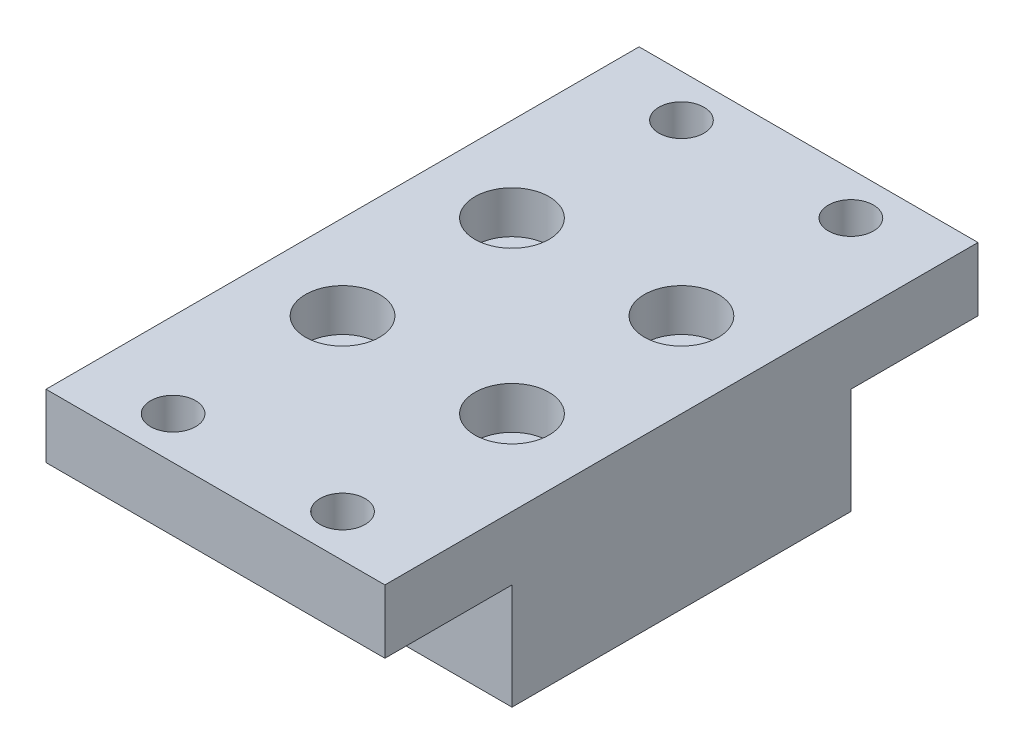
ISO-10303-21;
HEADER;
FILE_DESCRIPTION(('STEP AP214'),'2;1');
FILE_NAME('part.step','',(''),(''),'','','');
FILE_SCHEMA(('AUTOMOTIVE_DESIGN { 1 0 10303 214 1 1 1 1 }'));
ENDSEC;
DATA;
#1=APPLICATION_CONTEXT('core data for automotive mechanical design processes');
#2=APPLICATION_PROTOCOL_DEFINITION('international standard','automotive_design',2000,#1);
#3=PRODUCT_CONTEXT('',#1,'mechanical');
#4=PRODUCT('Part','Part','',(#3));
#5=PRODUCT_RELATED_PRODUCT_CATEGORY('part','',(#4));
#6=PRODUCT_DEFINITION_FORMATION('','',#4);
#7=PRODUCT_DEFINITION_CONTEXT('part definition',#1,'design');
#8=PRODUCT_DEFINITION('design','',#6,#7);
#9=PRODUCT_DEFINITION_SHAPE('','',#8);
#10=(LENGTH_UNIT() NAMED_UNIT(*) SI_UNIT(.MILLI.,.METRE.));
#11=(NAMED_UNIT(*) PLANE_ANGLE_UNIT() SI_UNIT($,.RADIAN.));
#12=(NAMED_UNIT(*) SI_UNIT($,.STERADIAN.) SOLID_ANGLE_UNIT());
#13=UNCERTAINTY_MEASURE_WITH_UNIT(LENGTH_MEASURE(1.E-05),#10,'distance_accuracy_value','');
#14=(GEOMETRIC_REPRESENTATION_CONTEXT(3) GLOBAL_UNCERTAINTY_ASSIGNED_CONTEXT((#13)) GLOBAL_UNIT_ASSIGNED_CONTEXT((#10,
#11,#12)) REPRESENTATION_CONTEXT('',''));
#15=CARTESIAN_POINT('',(0.,0.,0.));
#16=DIRECTION('',(0.,0.,1.));
#17=DIRECTION('',(1.,0.,0.));
#18=AXIS2_PLACEMENT_3D('',#15,#16,#17);
#19=CARTESIAN_POINT('',(0.,25.4,-50.8));
#20=DIRECTION('',(0.,-1.,0.));
#21=DIRECTION('',(0.,0.,-1.));
#22=AXIS2_PLACEMENT_3D('',#19,#20,#21);
#23=PLANE('',#22);
#24=CARTESIAN_POINT('',(12.7,25.4,-38.1));
#25=DIRECTION('',(0.,1.,0.));
#26=DIRECTION('',(0.,0.,1.));
#27=AXIS2_PLACEMENT_3D('',#24,#25,#26);
#28=CIRCLE('',#27,5.55625);
#29=CARTESIAN_POINT('',(12.7,25.4,-32.54375));
#30=VERTEX_POINT('',#29);
#31=EDGE_CURVE('E266',#30,#30,#28,.T.);
#32=ORIENTED_EDGE('',*,*,#31,.F.);
#33=EDGE_LOOP('',(#32));
#34=FACE_BOUND('',#33,.T.);
#35=CARTESIAN_POINT('',(38.1,25.4,12.7));
#36=DIRECTION('',(0.,1.,0.));
#37=DIRECTION('',(0.,0.,1.));
#38=AXIS2_PLACEMENT_3D('',#35,#36,#37);
#39=CIRCLE('',#38,3.3782);
#40=CARTESIAN_POINT('',(38.1,25.4,16.0782));
#41=VERTEX_POINT('',#40);
#42=EDGE_CURVE('E282',#41,#41,#39,.T.);
#43=ORIENTED_EDGE('',*,*,#42,.F.);
#44=EDGE_LOOP('',(#43));
#45=FACE_BOUND('',#44,.T.);
#46=CARTESIAN_POINT('',(38.1,25.4,-63.5));
#47=DIRECTION('',(0.,1.,0.));
#48=DIRECTION('',(0.,0.,1.));
#49=AXIS2_PLACEMENT_3D('',#46,#47,#48);
#50=CIRCLE('',#49,3.3782);
#51=CARTESIAN_POINT('',(38.1,25.4,-60.1218));
#52=VERTEX_POINT('',#51);
#53=EDGE_CURVE('E138',#52,#52,#50,.T.);
#54=ORIENTED_EDGE('',*,*,#53,.F.);
#55=EDGE_LOOP('',(#54));
#56=FACE_BOUND('',#55,.T.);
#57=CARTESIAN_POINT('',(12.7,25.4,-12.7));
#58=DIRECTION('',(0.,1.,0.));
#59=DIRECTION('',(0.,0.,1.));
#60=AXIS2_PLACEMENT_3D('',#57,#58,#59);
#61=CIRCLE('',#60,5.55625);
#62=CARTESIAN_POINT('',(12.7,25.4,-7.14375));
#63=VERTEX_POINT('',#62);
#64=EDGE_CURVE('E137',#63,#63,#61,.T.);
#65=ORIENTED_EDGE('',*,*,#64,.F.);
#66=EDGE_LOOP('',(#65));
#67=FACE_BOUND('',#66,.T.);
#68=CARTESIAN_POINT('',(12.7,25.4,-63.5));
#69=DIRECTION('',(0.,1.,0.));
#70=DIRECTION('',(0.,0.,1.));
#71=AXIS2_PLACEMENT_3D('',#68,#69,#70);
#72=CIRCLE('',#71,3.3782);
#73=CARTESIAN_POINT('',(12.7,25.4,-60.1218));
#74=VERTEX_POINT('',#73);
#75=EDGE_CURVE('E133',#74,#74,#72,.T.);
#76=ORIENTED_EDGE('',*,*,#75,.F.);
#77=EDGE_LOOP('',(#76));
#78=FACE_BOUND('',#77,.T.);
#79=DIRECTION('',(0.,0.,1.));
#80=VECTOR('',#79,1.);
#81=CARTESIAN_POINT('',(0.,25.4,0.));
#82=LINE('',#81,#80);
#83=CARTESIAN_POINT('',(0.,25.4,-69.85));
#84=VERTEX_POINT('',#83);
#85=CARTESIAN_POINT('',(0.,25.4,19.05));
#86=VERTEX_POINT('',#85);
#87=EDGE_CURVE('E193',#84,#86,#82,.T.);
#88=ORIENTED_EDGE('',*,*,#87,.T.);
#89=DIRECTION('',(-1.,0.,0.));
#90=VECTOR('',#89,1.);
#91=CARTESIAN_POINT('',(0.,25.4,19.05));
#92=LINE('',#91,#90);
#93=CARTESIAN_POINT('',(50.8,25.4,19.05));
#94=VERTEX_POINT('',#93);
#95=EDGE_CURVE('E117',#94,#86,#92,.T.);
#96=ORIENTED_EDGE('',*,*,#95,.F.);
#97=DIRECTION('',(0.,0.,-1.));
#98=VECTOR('',#97,1.);
#99=CARTESIAN_POINT('',(50.8,25.4,0.));
#100=LINE('',#99,#98);
#101=CARTESIAN_POINT('',(50.8,25.4,-69.85));
#102=VERTEX_POINT('',#101);
#103=EDGE_CURVE('E186',#94,#102,#100,.T.);
#104=ORIENTED_EDGE('',*,*,#103,.T.);
#105=DIRECTION('',(1.,0.,0.));
#106=VECTOR('',#105,1.);
#107=CARTESIAN_POINT('',(50.8,25.4,-69.85));
#108=LINE('',#107,#106);
#109=EDGE_CURVE('E207',#84,#102,#108,.T.);
#110=ORIENTED_EDGE('',*,*,#109,.F.);
#111=EDGE_LOOP('',(#88,#96,#104,#110));
#112=FACE_BOUND('',#111,.T.);
#113=CARTESIAN_POINT('',(12.7,25.4,12.7));
#114=DIRECTION('',(0.,1.,0.));
#115=DIRECTION('',(0.,0.,1.));
#116=AXIS2_PLACEMENT_3D('',#113,#114,#115);
#117=CIRCLE('',#116,3.3782);
#118=CARTESIAN_POINT('',(12.7,25.4,16.0782));
#119=VERTEX_POINT('',#118);
#120=EDGE_CURVE('E249',#119,#119,#117,.T.);
#121=ORIENTED_EDGE('',*,*,#120,.F.);
#122=EDGE_LOOP('',(#121));
#123=FACE_BOUND('',#122,.T.);
#124=CARTESIAN_POINT('',(38.1,25.4,-12.7));
#125=DIRECTION('',(0.,1.,0.));
#126=DIRECTION('',(0.,0.,1.));
#127=AXIS2_PLACEMENT_3D('',#124,#125,#126);
#128=CIRCLE('',#127,5.55625);
#129=CARTESIAN_POINT('',(38.1,25.4,-7.14375));
#130=VERTEX_POINT('',#129);
#131=EDGE_CURVE('E253',#130,#130,#128,.T.);
#132=ORIENTED_EDGE('',*,*,#131,.F.);
#133=EDGE_LOOP('',(#132));
#134=FACE_BOUND('',#133,.T.);
#135=CARTESIAN_POINT('',(38.1,25.4,-38.1));
#136=DIRECTION('',(0.,1.,0.));
#137=DIRECTION('',(0.,0.,1.));
#138=AXIS2_PLACEMENT_3D('',#135,#136,#137);
#139=CIRCLE('',#138,5.55625);
#140=CARTESIAN_POINT('',(38.1,25.4,-32.54375));
#141=VERTEX_POINT('',#140);
#142=EDGE_CURVE('E256',#141,#141,#139,.T.);
#143=ORIENTED_EDGE('',*,*,#142,.F.);
#144=EDGE_LOOP('',(#143));
#145=FACE_BOUND('',#144,.T.);
#146=ADVANCED_FACE('F34',(#34,#45,#56,#67,#78,#112,#123,#134,#145),#23,.F.);
#147=CARTESIAN_POINT('',(0.,25.4,0.));
#148=DIRECTION('',(0.,0.,-1.));
#149=DIRECTION('',(-1.,0.,0.));
#150=AXIS2_PLACEMENT_3D('',#147,#148,#149);
#151=PLANE('',#150);
#152=DIRECTION('',(1.,0.,0.));
#153=VECTOR('',#152,1.);
#154=CARTESIAN_POINT('',(0.,15.875,0.));
#155=LINE('',#154,#153);
#156=CARTESIAN_POINT('',(0.,15.875,0.));
#157=VERTEX_POINT('',#156);
#158=CARTESIAN_POINT('',(50.8,15.875,0.));
#159=VERTEX_POINT('',#158);
#160=EDGE_CURVE('E50',#157,#159,#155,.T.);
#161=ORIENTED_EDGE('',*,*,#160,.F.);
#162=DIRECTION('',(0.,-1.,0.));
#163=VECTOR('',#162,1.);
#164=CARTESIAN_POINT('',(0.,25.4,0.));
#165=LINE('',#164,#163);
#166=CARTESIAN_POINT('',(0.,0.,0.));
#167=VERTEX_POINT('',#166);
#168=EDGE_CURVE('E11',#157,#167,#165,.T.);
#169=ORIENTED_EDGE('',*,*,#168,.T.);
#170=DIRECTION('',(1.,0.,0.));
#171=VECTOR('',#170,1.);
#172=CARTESIAN_POINT('',(0.,0.,0.));
#173=LINE('',#172,#171);
#174=CARTESIAN_POINT('',(50.8,0.,0.));
#175=VERTEX_POINT('',#174);
#176=EDGE_CURVE('E197',#167,#175,#173,.T.);
#177=ORIENTED_EDGE('',*,*,#176,.T.);
#178=DIRECTION('',(0.,-1.,0.));
#179=VECTOR('',#178,1.);
#180=CARTESIAN_POINT('',(50.8,25.4,0.));
#181=LINE('',#180,#179);
#182=EDGE_CURVE('E43',#159,#175,#181,.T.);
#183=ORIENTED_EDGE('',*,*,#182,.F.);
#184=EDGE_LOOP('',(#161,#169,#177,#183));
#185=FACE_BOUND('',#184,.T.);
#186=ADVANCED_FACE('F229',(#185),#151,.F.);
#187=CARTESIAN_POINT('',(0.,25.4,-50.8));
#188=DIRECTION('',(0.,0.,1.));
#189=DIRECTION('',(1.,0.,0.));
#190=AXIS2_PLACEMENT_3D('',#187,#188,#189);
#191=PLANE('',#190);
#192=DIRECTION('',(-1.,0.,0.));
#193=VECTOR('',#192,1.);
#194=CARTESIAN_POINT('',(50.8,15.875,-50.8));
#195=LINE('',#194,#193);
#196=CARTESIAN_POINT('',(50.8,15.875,-50.8));
#197=VERTEX_POINT('',#196);
#198=CARTESIAN_POINT('',(0.,15.875,-50.8));
#199=VERTEX_POINT('',#198);
#200=EDGE_CURVE('E58',#197,#199,#195,.T.);
#201=ORIENTED_EDGE('',*,*,#200,.F.);
#202=DIRECTION('',(0.,-1.,0.));
#203=VECTOR('',#202,1.);
#204=CARTESIAN_POINT('',(50.8,25.4,-50.8));
#205=LINE('',#204,#203);
#206=CARTESIAN_POINT('',(50.8,0.,-50.8));
#207=VERTEX_POINT('',#206);
#208=EDGE_CURVE('E185',#197,#207,#205,.T.);
#209=ORIENTED_EDGE('',*,*,#208,.T.);
#210=DIRECTION('',(-1.,0.,0.));
#211=VECTOR('',#210,1.);
#212=CARTESIAN_POINT('',(0.,0.,-50.8));
#213=LINE('',#212,#211);
#214=CARTESIAN_POINT('',(0.,0.,-50.8));
#215=VERTEX_POINT('',#214);
#216=EDGE_CURVE('E189',#207,#215,#213,.T.);
#217=ORIENTED_EDGE('',*,*,#216,.T.);
#218=DIRECTION('',(0.,-1.,0.));
#219=VECTOR('',#218,1.);
#220=CARTESIAN_POINT('',(0.,25.4,-50.8));
#221=LINE('',#220,#219);
#222=EDGE_CURVE('E182',#199,#215,#221,.T.);
#223=ORIENTED_EDGE('',*,*,#222,.F.);
#224=EDGE_LOOP('',(#201,#209,#217,#223));
#225=FACE_BOUND('',#224,.T.);
#226=ADVANCED_FACE('F233',(#225),#191,.F.);
#227=CARTESIAN_POINT('',(0.,25.4,0.));
#228=DIRECTION('',(1.,0.,0.));
#229=DIRECTION('',(0.,0.,-1.));
#230=AXIS2_PLACEMENT_3D('',#227,#228,#229);
#231=PLANE('',#230);
#232=DIRECTION('',(0.,0.,1.));
#233=VECTOR('',#232,1.);
#234=CARTESIAN_POINT('',(0.,0.,0.));
#235=LINE('',#234,#233);
#236=EDGE_CURVE('E200',#215,#167,#235,.T.);
#237=ORIENTED_EDGE('',*,*,#236,.T.);
#238=ORIENTED_EDGE('',*,*,#168,.F.);
#239=DIRECTION('',(0.,0.,-1.));
#240=VECTOR('',#239,1.);
#241=CARTESIAN_POINT('',(0.,15.875,19.05));
#242=LINE('',#241,#240);
#243=CARTESIAN_POINT('',(0.,15.875,19.05));
#244=VERTEX_POINT('',#243);
#245=EDGE_CURVE('E104',#244,#157,#242,.T.);
#246=ORIENTED_EDGE('',*,*,#245,.F.);
#247=DIRECTION('',(0.,-1.,0.));
#248=VECTOR('',#247,1.);
#249=CARTESIAN_POINT('',(0.,25.4,19.05));
#250=LINE('',#249,#248);
#251=EDGE_CURVE('E111',#86,#244,#250,.T.);
#252=ORIENTED_EDGE('',*,*,#251,.F.);
#253=ORIENTED_EDGE('',*,*,#87,.F.);
#254=DIRECTION('',(0.,1.,0.));
#255=VECTOR('',#254,1.);
#256=CARTESIAN_POINT('',(0.,25.4,-69.85));
#257=LINE('',#256,#255);
#258=CARTESIAN_POINT('',(0.,15.875,-69.85));
#259=VERTEX_POINT('',#258);
#260=EDGE_CURVE('E236',#259,#84,#257,.T.);
#261=ORIENTED_EDGE('',*,*,#260,.F.);
#262=DIRECTION('',(0.,0.,1.));
#263=VECTOR('',#262,1.);
#264=CARTESIAN_POINT('',(0.,15.875,-69.85));
#265=LINE('',#264,#263);
#266=EDGE_CURVE('E210',#259,#199,#265,.T.);
#267=ORIENTED_EDGE('',*,*,#266,.T.);
#268=ORIENTED_EDGE('',*,*,#222,.T.);
#269=EDGE_LOOP('',(#237,#238,#246,#252,#253,#261,#267,#268));
#270=FACE_BOUND('',#269,.T.);
#271=ADVANCED_FACE('F36',(#270),#231,.F.);
#272=CARTESIAN_POINT('',(50.8,25.4,0.));
#273=DIRECTION('',(-1.,0.,0.));
#274=DIRECTION('',(0.,0.,1.));
#275=AXIS2_PLACEMENT_3D('',#272,#273,#274);
#276=PLANE('',#275);
#277=DIRECTION('',(0.,0.,-1.));
#278=VECTOR('',#277,1.);
#279=CARTESIAN_POINT('',(50.8,0.,0.));
#280=LINE('',#279,#278);
#281=EDGE_CURVE('E194',#175,#207,#280,.T.);
#282=ORIENTED_EDGE('',*,*,#281,.T.);
#283=ORIENTED_EDGE('',*,*,#208,.F.);
#284=DIRECTION('',(0.,0.,1.));
#285=VECTOR('',#284,1.);
#286=CARTESIAN_POINT('',(50.8,15.875,-69.85));
#287=LINE('',#286,#285);
#288=CARTESIAN_POINT('',(50.8,15.875,-69.85));
#289=VERTEX_POINT('',#288);
#290=EDGE_CURVE('E202',#289,#197,#287,.T.);
#291=ORIENTED_EDGE('',*,*,#290,.F.);
#292=DIRECTION('',(0.,-1.,0.));
#293=VECTOR('',#292,1.);
#294=CARTESIAN_POINT('',(50.8,25.4,-69.85));
#295=LINE('',#294,#293);
#296=EDGE_CURVE('E122',#102,#289,#295,.T.);
#297=ORIENTED_EDGE('',*,*,#296,.F.);
#298=ORIENTED_EDGE('',*,*,#103,.F.);
#299=DIRECTION('',(0.,1.,0.));
#300=VECTOR('',#299,1.);
#301=CARTESIAN_POINT('',(50.8,25.4,19.05));
#302=LINE('',#301,#300);
#303=CARTESIAN_POINT('',(50.8,15.875,19.05));
#304=VERTEX_POINT('',#303);
#305=EDGE_CURVE('E110',#304,#94,#302,.T.);
#306=ORIENTED_EDGE('',*,*,#305,.F.);
#307=DIRECTION('',(0.,0.,-1.));
#308=VECTOR('',#307,1.);
#309=CARTESIAN_POINT('',(50.8,15.875,19.05));
#310=LINE('',#309,#308);
#311=EDGE_CURVE('E106',#304,#159,#310,.T.);
#312=ORIENTED_EDGE('',*,*,#311,.T.);
#313=ORIENTED_EDGE('',*,*,#182,.T.);
#314=EDGE_LOOP('',(#282,#283,#291,#297,#298,#306,#312,#313));
#315=FACE_BOUND('',#314,.T.);
#316=ADVANCED_FACE('F225',(#315),#276,.F.);
#317=CARTESIAN_POINT('',(0.,0.,-50.8));
#318=DIRECTION('',(0.,-1.,0.));
#319=DIRECTION('',(0.,0.,-1.));
#320=AXIS2_PLACEMENT_3D('',#317,#318,#319);
#321=PLANE('',#320);
#322=CARTESIAN_POINT('',(38.1,0.,-12.7));
#323=DIRECTION('',(0.,-1.,0.));
#324=DIRECTION('',(0.,0.,-1.));
#325=AXIS2_PLACEMENT_3D('',#322,#323,#324);
#326=CIRCLE('',#325,3.37819999999999);
#327=CARTESIAN_POINT('',(38.1,0.,-16.0782));
#328=VERTEX_POINT('',#327);
#329=EDGE_CURVE('E147',#328,#328,#326,.T.);
#330=ORIENTED_EDGE('',*,*,#329,.F.);
#331=EDGE_LOOP('',(#330));
#332=FACE_BOUND('',#331,.T.);
#333=CARTESIAN_POINT('',(38.1,0.,-38.1));
#334=DIRECTION('',(0.,-1.,0.));
#335=DIRECTION('',(0.,0.,-1.));
#336=AXIS2_PLACEMENT_3D('',#333,#334,#335);
#337=CIRCLE('',#336,3.37819999999999);
#338=CARTESIAN_POINT('',(38.1,0.,-41.4782));
#339=VERTEX_POINT('',#338);
#340=EDGE_CURVE('E141',#339,#339,#337,.T.);
#341=ORIENTED_EDGE('',*,*,#340,.F.);
#342=EDGE_LOOP('',(#341));
#343=FACE_BOUND('',#342,.T.);
#344=CARTESIAN_POINT('',(12.7,0.,-38.1));
#345=DIRECTION('',(0.,-1.,0.));
#346=DIRECTION('',(0.,0.,-1.));
#347=AXIS2_PLACEMENT_3D('',#344,#345,#346);
#348=CIRCLE('',#347,3.3782);
#349=CARTESIAN_POINT('',(12.7,0.,-41.4782));
#350=VERTEX_POINT('',#349);
#351=EDGE_CURVE('E139',#350,#350,#348,.T.);
#352=ORIENTED_EDGE('',*,*,#351,.F.);
#353=EDGE_LOOP('',(#352));
#354=FACE_BOUND('',#353,.T.);
#355=CARTESIAN_POINT('',(12.7,0.,-12.7));
#356=DIRECTION('',(0.,-1.,0.));
#357=DIRECTION('',(0.,0.,-1.));
#358=AXIS2_PLACEMENT_3D('',#355,#356,#357);
#359=CIRCLE('',#358,3.3782);
#360=CARTESIAN_POINT('',(12.7,0.,-16.0782));
#361=VERTEX_POINT('',#360);
#362=EDGE_CURVE('E130',#361,#361,#359,.T.);
#363=ORIENTED_EDGE('',*,*,#362,.F.);
#364=EDGE_LOOP('',(#363));
#365=FACE_BOUND('',#364,.T.);
#366=ORIENTED_EDGE('',*,*,#236,.F.);
#367=ORIENTED_EDGE('',*,*,#216,.F.);
#368=ORIENTED_EDGE('',*,*,#281,.F.);
#369=ORIENTED_EDGE('',*,*,#176,.F.);
#370=EDGE_LOOP('',(#366,#367,#368,#369));
#371=FACE_BOUND('',#370,.T.);
#372=ADVANCED_FACE('F232',(#332,#343,#354,#365,#371),#321,.T.);
#373=CARTESIAN_POINT('',(50.8,15.875,-69.85));
#374=DIRECTION('',(0.,1.,0.));
#375=DIRECTION('',(0.,0.,1.));
#376=AXIS2_PLACEMENT_3D('',#373,#374,#375);
#377=PLANE('',#376);
#378=CARTESIAN_POINT('',(38.1,15.875,-63.5));
#379=DIRECTION('',(0.,1.,0.));
#380=DIRECTION('',(0.,0.,1.));
#381=AXIS2_PLACEMENT_3D('',#378,#379,#380);
#382=CIRCLE('',#381,3.37819999999999);
#383=CARTESIAN_POINT('',(38.1,15.875,-60.1218));
#384=VERTEX_POINT('',#383);
#385=EDGE_CURVE('E135',#384,#384,#382,.T.);
#386=ORIENTED_EDGE('',*,*,#385,.T.);
#387=EDGE_LOOP('',(#386));
#388=FACE_BOUND('',#387,.T.);
#389=CARTESIAN_POINT('',(12.7,15.875,-63.5));
#390=DIRECTION('',(0.,1.,0.));
#391=DIRECTION('',(0.,0.,1.));
#392=AXIS2_PLACEMENT_3D('',#389,#390,#391);
#393=CIRCLE('',#392,3.3782);
#394=CARTESIAN_POINT('',(12.7,15.875,-60.1218));
#395=VERTEX_POINT('',#394);
#396=EDGE_CURVE('E165',#395,#395,#393,.T.);
#397=ORIENTED_EDGE('',*,*,#396,.T.);
#398=EDGE_LOOP('',(#397));
#399=FACE_BOUND('',#398,.T.);
#400=ORIENTED_EDGE('',*,*,#200,.T.);
#401=ORIENTED_EDGE('',*,*,#266,.F.);
#402=DIRECTION('',(-1.,0.,0.));
#403=VECTOR('',#402,1.);
#404=CARTESIAN_POINT('',(50.8,15.875,-69.85));
#405=LINE('',#404,#403);
#406=EDGE_CURVE('E221',#289,#259,#405,.T.);
#407=ORIENTED_EDGE('',*,*,#406,.F.);
#408=ORIENTED_EDGE('',*,*,#290,.T.);
#409=EDGE_LOOP('',(#400,#401,#407,#408));
#410=FACE_BOUND('',#409,.T.);
#411=ADVANCED_FACE('F219',(#388,#399,#410),#377,.F.);
#412=CARTESIAN_POINT('',(50.8,15.875,-69.85));
#413=DIRECTION('',(0.,0.,-1.));
#414=DIRECTION('',(-1.,0.,0.));
#415=AXIS2_PLACEMENT_3D('',#412,#413,#414);
#416=PLANE('',#415);
#417=ORIENTED_EDGE('',*,*,#296,.T.);
#418=ORIENTED_EDGE('',*,*,#406,.T.);
#419=ORIENTED_EDGE('',*,*,#260,.T.);
#420=ORIENTED_EDGE('',*,*,#109,.T.);
#421=EDGE_LOOP('',(#417,#418,#419,#420));
#422=FACE_BOUND('',#421,.T.);
#423=ADVANCED_FACE('F240',(#422),#416,.T.);
#424=CARTESIAN_POINT('',(0.,15.875,19.05));
#425=DIRECTION('',(0.,1.,0.));
#426=DIRECTION('',(0.,0.,1.));
#427=AXIS2_PLACEMENT_3D('',#424,#425,#426);
#428=PLANE('',#427);
#429=CARTESIAN_POINT('',(38.1,15.875,12.7));
#430=DIRECTION('',(0.,1.,0.));
#431=DIRECTION('',(0.,0.,1.));
#432=AXIS2_PLACEMENT_3D('',#429,#430,#431);
#433=CIRCLE('',#432,3.37819999999999);
#434=CARTESIAN_POINT('',(38.1,15.875,16.0782));
#435=VERTEX_POINT('',#434);
#436=EDGE_CURVE('E38',#435,#435,#433,.T.);
#437=ORIENTED_EDGE('',*,*,#436,.T.);
#438=EDGE_LOOP('',(#437));
#439=FACE_BOUND('',#438,.T.);
#440=CARTESIAN_POINT('',(12.7,15.875,12.7));
#441=DIRECTION('',(0.,1.,0.));
#442=DIRECTION('',(0.,0.,1.));
#443=AXIS2_PLACEMENT_3D('',#440,#441,#442);
#444=CIRCLE('',#443,3.3782);
#445=CARTESIAN_POINT('',(12.7,15.875,16.0782));
#446=VERTEX_POINT('',#445);
#447=EDGE_CURVE('E152',#446,#446,#444,.T.);
#448=ORIENTED_EDGE('',*,*,#447,.T.);
#449=EDGE_LOOP('',(#448));
#450=FACE_BOUND('',#449,.T.);
#451=ORIENTED_EDGE('',*,*,#160,.T.);
#452=ORIENTED_EDGE('',*,*,#311,.F.);
#453=DIRECTION('',(1.,0.,0.));
#454=VECTOR('',#453,1.);
#455=CARTESIAN_POINT('',(0.,15.875,19.05));
#456=LINE('',#455,#454);
#457=EDGE_CURVE('E100',#244,#304,#456,.T.);
#458=ORIENTED_EDGE('',*,*,#457,.F.);
#459=ORIENTED_EDGE('',*,*,#245,.T.);
#460=EDGE_LOOP('',(#451,#452,#458,#459));
#461=FACE_BOUND('',#460,.T.);
#462=ADVANCED_FACE('F102',(#439,#450,#461),#428,.F.);
#463=CARTESIAN_POINT('',(0.,15.875,19.05));
#464=DIRECTION('',(0.,0.,1.));
#465=DIRECTION('',(1.,0.,0.));
#466=AXIS2_PLACEMENT_3D('',#463,#464,#465);
#467=PLANE('',#466);
#468=ORIENTED_EDGE('',*,*,#251,.T.);
#469=ORIENTED_EDGE('',*,*,#457,.T.);
#470=ORIENTED_EDGE('',*,*,#305,.T.);
#471=ORIENTED_EDGE('',*,*,#95,.T.);
#472=EDGE_LOOP('',(#468,#469,#470,#471));
#473=FACE_BOUND('',#472,.T.);
#474=ADVANCED_FACE('F115',(#473),#467,.T.);
#475=CARTESIAN_POINT('',(12.7,25.4,-63.5));
#476=DIRECTION('',(0.,1.,0.));
#477=DIRECTION('',(0.,0.,1.));
#478=AXIS2_PLACEMENT_3D('',#475,#476,#477);
#479=CYLINDRICAL_SURFACE('',#478,3.3782);
#480=ORIENTED_EDGE('',*,*,#75,.T.);
#481=EDGE_LOOP('',(#480));
#482=FACE_BOUND('',#481,.T.);
#483=ORIENTED_EDGE('',*,*,#396,.F.);
#484=EDGE_LOOP('',(#483));
#485=FACE_BOUND('',#484,.T.);
#486=ADVANCED_FACE('F329',(#482,#485),#479,.F.);
#487=CARTESIAN_POINT('',(12.7,25.4,-12.7));
#488=DIRECTION('',(0.,1.,0.));
#489=DIRECTION('',(0.,0.,1.));
#490=AXIS2_PLACEMENT_3D('',#487,#488,#489);
#491=CYLINDRICAL_SURFACE('',#490,3.3782);
#492=ORIENTED_EDGE('',*,*,#362,.T.);
#493=EDGE_LOOP('',(#492));
#494=FACE_BOUND('',#493,.T.);
#495=CARTESIAN_POINT('',(12.7,19.05,-12.7));
#496=DIRECTION('',(0.,1.,0.));
#497=DIRECTION('',(0.,0.,1.));
#498=AXIS2_PLACEMENT_3D('',#495,#496,#497);
#499=CIRCLE('',#498,3.3782);
#500=CARTESIAN_POINT('',(12.7,19.05,-9.3218));
#501=VERTEX_POINT('',#500);
#502=EDGE_CURVE('E134',#501,#501,#499,.T.);
#503=ORIENTED_EDGE('',*,*,#502,.T.);
#504=EDGE_LOOP('',(#503));
#505=FACE_BOUND('',#504,.T.);
#506=ADVANCED_FACE('F325',(#494,#505),#491,.F.);
#507=CARTESIAN_POINT('',(16.0782,19.05,-12.7));
#508=DIRECTION('',(0.,-1.,0.));
#509=DIRECTION('',(0.,0.,-1.));
#510=AXIS2_PLACEMENT_3D('',#507,#508,#509);
#511=PLANE('',#510);
#512=ORIENTED_EDGE('',*,*,#502,.F.);
#513=EDGE_LOOP('',(#512));
#514=FACE_BOUND('',#513,.T.);
#515=CARTESIAN_POINT('',(12.7,19.05,-12.7));
#516=DIRECTION('',(0.,1.,0.));
#517=DIRECTION('',(0.,0.,1.));
#518=AXIS2_PLACEMENT_3D('',#515,#516,#517);
#519=CIRCLE('',#518,5.55625);
#520=CARTESIAN_POINT('',(12.7,19.05,-7.14375));
#521=VERTEX_POINT('',#520);
#522=EDGE_CURVE('E158',#521,#521,#519,.T.);
#523=ORIENTED_EDGE('',*,*,#522,.T.);
#524=EDGE_LOOP('',(#523));
#525=FACE_BOUND('',#524,.T.);
#526=ADVANCED_FACE('F321',(#514,#525),#511,.F.);
#527=CARTESIAN_POINT('',(12.7,25.4,-12.7));
#528=DIRECTION('',(0.,1.,0.));
#529=DIRECTION('',(0.,0.,1.));
#530=AXIS2_PLACEMENT_3D('',#527,#528,#529);
#531=CYLINDRICAL_SURFACE('',#530,5.55625);
#532=ORIENTED_EDGE('',*,*,#522,.F.);
#533=EDGE_LOOP('',(#532));
#534=FACE_BOUND('',#533,.T.);
#535=ORIENTED_EDGE('',*,*,#64,.T.);
#536=EDGE_LOOP('',(#535));
#537=FACE_BOUND('',#536,.T.);
#538=ADVANCED_FACE('F317',(#534,#537),#531,.F.);
#539=CARTESIAN_POINT('',(38.1,25.4,-63.5));
#540=DIRECTION('',(0.,1.,0.));
#541=DIRECTION('',(0.,0.,1.));
#542=AXIS2_PLACEMENT_3D('',#539,#540,#541);
#543=CYLINDRICAL_SURFACE('',#542,3.37819999999999);
#544=ORIENTED_EDGE('',*,*,#53,.T.);
#545=EDGE_LOOP('',(#544));
#546=FACE_BOUND('',#545,.T.);
#547=ORIENTED_EDGE('',*,*,#385,.F.);
#548=EDGE_LOOP('',(#547));
#549=FACE_BOUND('',#548,.T.);
#550=ADVANCED_FACE('F313',(#546,#549),#543,.F.);
#551=CARTESIAN_POINT('',(12.7,25.4,-38.1));
#552=DIRECTION('',(0.,1.,0.));
#553=DIRECTION('',(0.,0.,1.));
#554=AXIS2_PLACEMENT_3D('',#551,#552,#553);
#555=CYLINDRICAL_SURFACE('',#554,3.3782);
#556=CARTESIAN_POINT('',(12.7,19.05,-38.1));
#557=DIRECTION('',(0.,1.,0.));
#558=DIRECTION('',(0.,0.,1.));
#559=AXIS2_PLACEMENT_3D('',#556,#557,#558);
#560=CIRCLE('',#559,3.3782);
#561=CARTESIAN_POINT('',(12.7,19.05,-34.7218));
#562=VERTEX_POINT('',#561);
#563=EDGE_CURVE('E272',#562,#562,#560,.T.);
#564=ORIENTED_EDGE('',*,*,#563,.T.);
#565=EDGE_LOOP('',(#564));
#566=FACE_BOUND('',#565,.T.);
#567=ORIENTED_EDGE('',*,*,#351,.T.);
#568=EDGE_LOOP('',(#567));
#569=FACE_BOUND('',#568,.T.);
#570=ADVANCED_FACE('F309',(#566,#569),#555,.F.);
#571=CARTESIAN_POINT('',(38.1,25.4,-38.1));
#572=DIRECTION('',(0.,1.,0.));
#573=DIRECTION('',(0.,0.,1.));
#574=AXIS2_PLACEMENT_3D('',#571,#572,#573);
#575=CYLINDRICAL_SURFACE('',#574,3.37819999999999);
#576=CARTESIAN_POINT('',(38.1,19.05,-38.1));
#577=DIRECTION('',(0.,1.,0.));
#578=DIRECTION('',(0.,0.,1.));
#579=AXIS2_PLACEMENT_3D('',#576,#577,#578);
#580=CIRCLE('',#579,3.3782);
#581=CARTESIAN_POINT('',(38.1,19.05,-34.7218));
#582=VERTEX_POINT('',#581);
#583=EDGE_CURVE('E261',#582,#582,#580,.T.);
#584=ORIENTED_EDGE('',*,*,#583,.T.);
#585=EDGE_LOOP('',(#584));
#586=FACE_BOUND('',#585,.T.);
#587=ORIENTED_EDGE('',*,*,#340,.T.);
#588=EDGE_LOOP('',(#587));
#589=FACE_BOUND('',#588,.T.);
#590=ADVANCED_FACE('F302',(#586,#589),#575,.F.);
#591=CARTESIAN_POINT('',(38.1,25.4,-12.7));
#592=DIRECTION('',(0.,1.,0.));
#593=DIRECTION('',(0.,0.,1.));
#594=AXIS2_PLACEMENT_3D('',#591,#592,#593);
#595=CYLINDRICAL_SURFACE('',#594,3.37819999999999);
#596=CARTESIAN_POINT('',(38.1,19.05,-12.7));
#597=DIRECTION('',(0.,1.,0.));
#598=DIRECTION('',(0.,0.,1.));
#599=AXIS2_PLACEMENT_3D('',#596,#597,#598);
#600=CIRCLE('',#599,3.3782);
#601=CARTESIAN_POINT('',(38.1,19.05,-9.3218));
#602=VERTEX_POINT('',#601);
#603=EDGE_CURVE('E279',#602,#602,#600,.T.);
#604=ORIENTED_EDGE('',*,*,#603,.T.);
#605=EDGE_LOOP('',(#604));
#606=FACE_BOUND('',#605,.T.);
#607=ORIENTED_EDGE('',*,*,#329,.T.);
#608=EDGE_LOOP('',(#607));
#609=FACE_BOUND('',#608,.T.);
#610=ADVANCED_FACE('F292',(#606,#609),#595,.F.);
#611=CARTESIAN_POINT('',(12.7,25.4,12.7));
#612=DIRECTION('',(0.,1.,0.));
#613=DIRECTION('',(0.,0.,1.));
#614=AXIS2_PLACEMENT_3D('',#611,#612,#613);
#615=CYLINDRICAL_SURFACE('',#614,3.3782);
#616=ORIENTED_EDGE('',*,*,#120,.T.);
#617=EDGE_LOOP('',(#616));
#618=FACE_BOUND('',#617,.T.);
#619=ORIENTED_EDGE('',*,*,#447,.F.);
#620=EDGE_LOOP('',(#619));
#621=FACE_BOUND('',#620,.T.);
#622=ADVANCED_FACE('F289',(#618,#621),#615,.F.);
#623=CARTESIAN_POINT('',(38.1,25.4,12.7));
#624=DIRECTION('',(0.,1.,0.));
#625=DIRECTION('',(0.,0.,1.));
#626=AXIS2_PLACEMENT_3D('',#623,#624,#625);
#627=CYLINDRICAL_SURFACE('',#626,3.37819999999999);
#628=ORIENTED_EDGE('',*,*,#42,.T.);
#629=EDGE_LOOP('',(#628));
#630=FACE_BOUND('',#629,.T.);
#631=ORIENTED_EDGE('',*,*,#436,.F.);
#632=EDGE_LOOP('',(#631));
#633=FACE_BOUND('',#632,.T.);
#634=ADVANCED_FACE('F291',(#630,#633),#627,.F.);
#635=CARTESIAN_POINT('',(41.4782,19.05,-12.7));
#636=DIRECTION('',(0.,-1.,0.));
#637=DIRECTION('',(0.,0.,-1.));
#638=AXIS2_PLACEMENT_3D('',#635,#636,#637);
#639=PLANE('',#638);
#640=ORIENTED_EDGE('',*,*,#603,.F.);
#641=EDGE_LOOP('',(#640));
#642=FACE_BOUND('',#641,.T.);
#643=CARTESIAN_POINT('',(38.1,19.05,-12.7));
#644=DIRECTION('',(0.,1.,0.));
#645=DIRECTION('',(0.,0.,1.));
#646=AXIS2_PLACEMENT_3D('',#643,#644,#645);
#647=CIRCLE('',#646,5.55625);
#648=CARTESIAN_POINT('',(38.1,19.05,-7.14375));
#649=VERTEX_POINT('',#648);
#650=EDGE_CURVE('E276',#649,#649,#647,.T.);
#651=ORIENTED_EDGE('',*,*,#650,.T.);
#652=EDGE_LOOP('',(#651));
#653=FACE_BOUND('',#652,.T.);
#654=ADVANCED_FACE('F299',(#642,#653),#639,.F.);
#655=CARTESIAN_POINT('',(38.1,25.4,-12.7));
#656=DIRECTION('',(0.,1.,0.));
#657=DIRECTION('',(0.,0.,1.));
#658=AXIS2_PLACEMENT_3D('',#655,#656,#657);
#659=CYLINDRICAL_SURFACE('',#658,5.55625);
#660=ORIENTED_EDGE('',*,*,#650,.F.);
#661=EDGE_LOOP('',(#660));
#662=FACE_BOUND('',#661,.T.);
#663=ORIENTED_EDGE('',*,*,#131,.T.);
#664=EDGE_LOOP('',(#663));
#665=FACE_BOUND('',#664,.T.);
#666=ADVANCED_FACE('F430',(#662,#665),#659,.F.);
#667=CARTESIAN_POINT('',(16.0782,19.05,-38.1));
#668=DIRECTION('',(0.,-1.,0.));
#669=DIRECTION('',(0.,0.,-1.));
#670=AXIS2_PLACEMENT_3D('',#667,#668,#669);
#671=PLANE('',#670);
#672=ORIENTED_EDGE('',*,*,#563,.F.);
#673=EDGE_LOOP('',(#672));
#674=FACE_BOUND('',#673,.T.);
#675=CARTESIAN_POINT('',(12.7,19.05,-38.1));
#676=DIRECTION('',(0.,1.,0.));
#677=DIRECTION('',(0.,0.,1.));
#678=AXIS2_PLACEMENT_3D('',#675,#676,#677);
#679=CIRCLE('',#678,5.55625);
#680=CARTESIAN_POINT('',(12.7,19.05,-32.54375));
#681=VERTEX_POINT('',#680);
#682=EDGE_CURVE('E269',#681,#681,#679,.T.);
#683=ORIENTED_EDGE('',*,*,#682,.T.);
#684=EDGE_LOOP('',(#683));
#685=FACE_BOUND('',#684,.T.);
#686=ADVANCED_FACE('F440',(#674,#685),#671,.F.);
#687=CARTESIAN_POINT('',(12.7,25.4,-38.1));
#688=DIRECTION('',(0.,1.,0.));
#689=DIRECTION('',(0.,0.,1.));
#690=AXIS2_PLACEMENT_3D('',#687,#688,#689);
#691=CYLINDRICAL_SURFACE('',#690,5.55625);
#692=ORIENTED_EDGE('',*,*,#682,.F.);
#693=EDGE_LOOP('',(#692));
#694=FACE_BOUND('',#693,.T.);
#695=ORIENTED_EDGE('',*,*,#31,.T.);
#696=EDGE_LOOP('',(#695));
#697=FACE_BOUND('',#696,.T.);
#698=ADVANCED_FACE('F450',(#694,#697),#691,.F.);
#699=CARTESIAN_POINT('',(41.4782,19.05,-38.1));
#700=DIRECTION('',(0.,-1.,0.));
#701=DIRECTION('',(0.,0.,-1.));
#702=AXIS2_PLACEMENT_3D('',#699,#700,#701);
#703=PLANE('',#702);
#704=ORIENTED_EDGE('',*,*,#583,.F.);
#705=EDGE_LOOP('',(#704));
#706=FACE_BOUND('',#705,.T.);
#707=CARTESIAN_POINT('',(38.1,19.05,-38.1));
#708=DIRECTION('',(0.,1.,0.));
#709=DIRECTION('',(0.,0.,1.));
#710=AXIS2_PLACEMENT_3D('',#707,#708,#709);
#711=CIRCLE('',#710,5.55625);
#712=CARTESIAN_POINT('',(38.1,19.05,-32.54375));
#713=VERTEX_POINT('',#712);
#714=EDGE_CURVE('E258',#713,#713,#711,.T.);
#715=ORIENTED_EDGE('',*,*,#714,.T.);
#716=EDGE_LOOP('',(#715));
#717=FACE_BOUND('',#716,.T.);
#718=ADVANCED_FACE('F460',(#706,#717),#703,.F.);
#719=CARTESIAN_POINT('',(38.1,25.4,-38.1));
#720=DIRECTION('',(0.,1.,0.));
#721=DIRECTION('',(0.,0.,1.));
#722=AXIS2_PLACEMENT_3D('',#719,#720,#721);
#723=CYLINDRICAL_SURFACE('',#722,5.55625);
#724=ORIENTED_EDGE('',*,*,#714,.F.);
#725=EDGE_LOOP('',(#724));
#726=FACE_BOUND('',#725,.T.);
#727=ORIENTED_EDGE('',*,*,#142,.T.);
#728=EDGE_LOOP('',(#727));
#729=FACE_BOUND('',#728,.T.);
#730=ADVANCED_FACE('F470',(#726,#729),#723,.F.);
#731=CLOSED_SHELL('',(#146,#186,#226,#271,#316,#372,#411,#423,#462,#474,#486,#506,#526,#538,
#550,#570,#590,#610,#622,#634,#654,#666,#686,#698,#718,#730));
#732=MANIFOLD_SOLID_BREP('B2',#731);
#733=ADVANCED_BREP_SHAPE_REPRESENTATION('',(#18,#732),#14);
#734=SHAPE_DEFINITION_REPRESENTATION(#9,#733);
ENDSEC;
END-ISO-10303-21;
